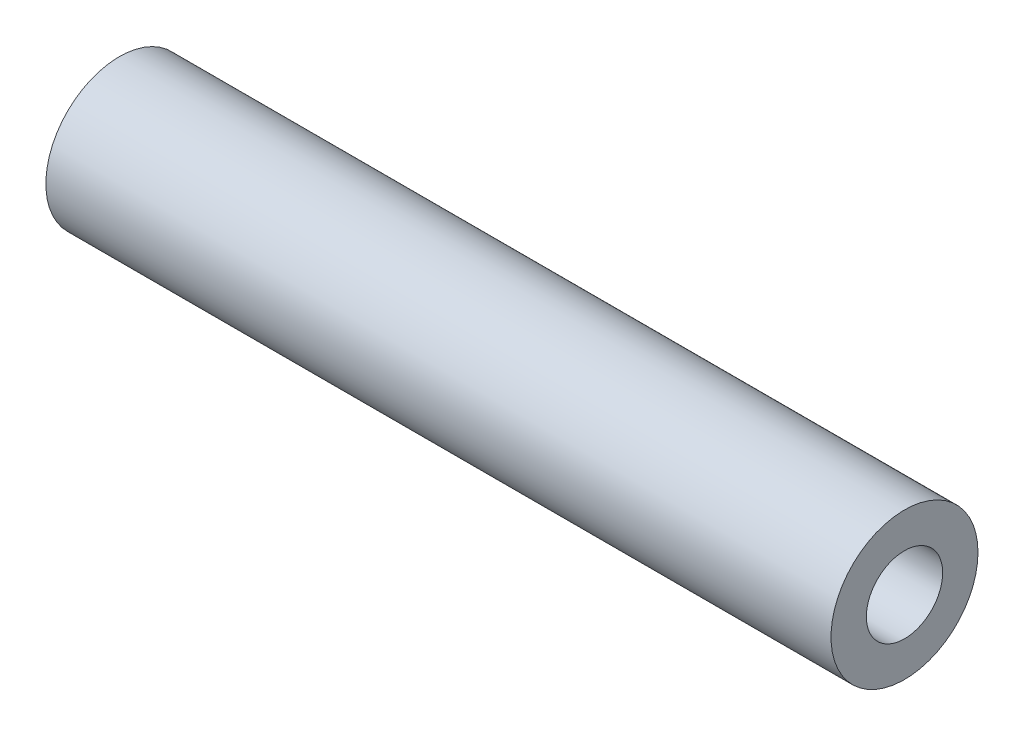
ISO-10303-21;
HEADER;
FILE_DESCRIPTION(('STEP AP214'),'2;1');
FILE_NAME('part.step','',(''),(''),'','','');
FILE_SCHEMA(('AUTOMOTIVE_DESIGN { 1 0 10303 214 1 1 1 1 }'));
ENDSEC;
DATA;
#1=APPLICATION_CONTEXT('core data for automotive mechanical design processes');
#2=APPLICATION_PROTOCOL_DEFINITION('international standard','automotive_design',2000,#1);
#3=PRODUCT_CONTEXT('',#1,'mechanical');
#4=PRODUCT('Part','Part','',(#3));
#5=PRODUCT_RELATED_PRODUCT_CATEGORY('part','',(#4));
#6=PRODUCT_DEFINITION_FORMATION('','',#4);
#7=PRODUCT_DEFINITION_CONTEXT('part definition',#1,'design');
#8=PRODUCT_DEFINITION('design','',#6,#7);
#9=PRODUCT_DEFINITION_SHAPE('','',#8);
#10=(LENGTH_UNIT() NAMED_UNIT(*) SI_UNIT(.MILLI.,.METRE.));
#11=(NAMED_UNIT(*) PLANE_ANGLE_UNIT() SI_UNIT($,.RADIAN.));
#12=(NAMED_UNIT(*) SI_UNIT($,.STERADIAN.) SOLID_ANGLE_UNIT());
#13=UNCERTAINTY_MEASURE_WITH_UNIT(LENGTH_MEASURE(1.E-05),#10,'distance_accuracy_value','');
#14=(GEOMETRIC_REPRESENTATION_CONTEXT(3) GLOBAL_UNCERTAINTY_ASSIGNED_CONTEXT((#13)) GLOBAL_UNIT_ASSIGNED_CONTEXT((#10,
#11,#12)) REPRESENTATION_CONTEXT('',''));
#15=CARTESIAN_POINT('',(0.,0.,0.));
#16=DIRECTION('',(0.,0.,1.));
#17=DIRECTION('',(1.,0.,0.));
#18=AXIS2_PLACEMENT_3D('',#15,#16,#17);
#19=CARTESIAN_POINT('',(457.2,0.,0.));
#20=DIRECTION('',(1.,0.,0.));
#21=DIRECTION('',(0.,0.,-1.));
#22=AXIS2_PLACEMENT_3D('',#19,#20,#21);
#23=PLANE('',#22);
#24=CARTESIAN_POINT('',(457.2,0.,0.));
#25=DIRECTION('',(1.,0.,0.));
#26=DIRECTION('',(0.,0.,-1.));
#27=AXIS2_PLACEMENT_3D('',#24,#25,#26);
#28=CIRCLE('',#27,42.799);
#29=CARTESIAN_POINT('',(457.2,0.,-42.799));
#30=VERTEX_POINT('',#29);
#31=EDGE_CURVE('E10',#30,#30,#28,.T.);
#32=ORIENTED_EDGE('',*,*,#31,.T.);
#33=EDGE_LOOP('',(#32));
#34=FACE_BOUND('',#33,.T.);
#35=CARTESIAN_POINT('',(457.2,0.,0.));
#36=DIRECTION('',(1.,0.,0.));
#37=DIRECTION('',(0.,0.,-1.));
#38=AXIS2_PLACEMENT_3D('',#35,#36,#37);
#39=CIRCLE('',#38,22.225);
#40=CARTESIAN_POINT('',(457.2,0.,-22.225));
#41=VERTEX_POINT('',#40);
#42=EDGE_CURVE('E50',#41,#41,#39,.T.);
#43=ORIENTED_EDGE('',*,*,#42,.F.);
#44=EDGE_LOOP('',(#43));
#45=FACE_BOUND('',#44,.T.);
#46=ADVANCED_FACE('F39',(#34,#45),#23,.T.);
#47=CARTESIAN_POINT('',(0.,0.,0.));
#48=DIRECTION('',(1.,0.,0.));
#49=DIRECTION('',(0.,0.,-1.));
#50=AXIS2_PLACEMENT_3D('',#47,#48,#49);
#51=PLANE('',#50);
#52=CARTESIAN_POINT('',(0.,0.,0.));
#53=DIRECTION('',(1.,0.,0.));
#54=DIRECTION('',(0.,0.,-1.));
#55=AXIS2_PLACEMENT_3D('',#52,#53,#54);
#56=CIRCLE('',#55,42.799);
#57=CARTESIAN_POINT('',(0.,0.,-42.799));
#58=VERTEX_POINT('',#57);
#59=EDGE_CURVE('E43',#58,#58,#56,.T.);
#60=ORIENTED_EDGE('',*,*,#59,.F.);
#61=EDGE_LOOP('',(#60));
#62=FACE_BOUND('',#61,.T.);
#63=CARTESIAN_POINT('',(0.,0.,0.));
#64=DIRECTION('',(1.,0.,0.));
#65=DIRECTION('',(0.,0.,-1.));
#66=AXIS2_PLACEMENT_3D('',#63,#64,#65);
#67=CIRCLE('',#66,22.225);
#68=CARTESIAN_POINT('',(0.,0.,-22.225));
#69=VERTEX_POINT('',#68);
#70=EDGE_CURVE('E52',#69,#69,#67,.T.);
#71=ORIENTED_EDGE('',*,*,#70,.T.);
#72=EDGE_LOOP('',(#71));
#73=FACE_BOUND('',#72,.T.);
#74=ADVANCED_FACE('F62',(#62,#73),#51,.F.);
#75=CARTESIAN_POINT('',(457.2,0.,0.));
#76=DIRECTION('',(-1.,0.,0.));
#77=DIRECTION('',(0.,0.,1.));
#78=AXIS2_PLACEMENT_3D('',#75,#76,#77);
#79=CYLINDRICAL_SURFACE('',#78,42.799);
#80=ORIENTED_EDGE('',*,*,#31,.F.);
#81=EDGE_LOOP('',(#80));
#82=FACE_BOUND('',#81,.T.);
#83=ORIENTED_EDGE('',*,*,#59,.T.);
#84=EDGE_LOOP('',(#83));
#85=FACE_BOUND('',#84,.T.);
#86=ADVANCED_FACE('F41',(#82,#85),#79,.T.);
#87=CARTESIAN_POINT('',(457.2,0.,0.));
#88=DIRECTION('',(-1.,0.,0.));
#89=DIRECTION('',(0.,0.,1.));
#90=AXIS2_PLACEMENT_3D('',#87,#88,#89);
#91=CYLINDRICAL_SURFACE('',#90,22.225);
#92=ORIENTED_EDGE('',*,*,#42,.T.);
#93=EDGE_LOOP('',(#92));
#94=FACE_BOUND('',#93,.T.);
#95=ORIENTED_EDGE('',*,*,#70,.F.);
#96=EDGE_LOOP('',(#95));
#97=FACE_BOUND('',#96,.T.);
#98=ADVANCED_FACE('F58',(#94,#97),#91,.F.);
#99=CLOSED_SHELL('',(#46,#74,#86,#98));
#100=MANIFOLD_SOLID_BREP('B2',#99);
#101=ADVANCED_BREP_SHAPE_REPRESENTATION('',(#18,#100),#14);
#102=SHAPE_DEFINITION_REPRESENTATION(#9,#101);
ENDSEC;
END-ISO-10303-21;
